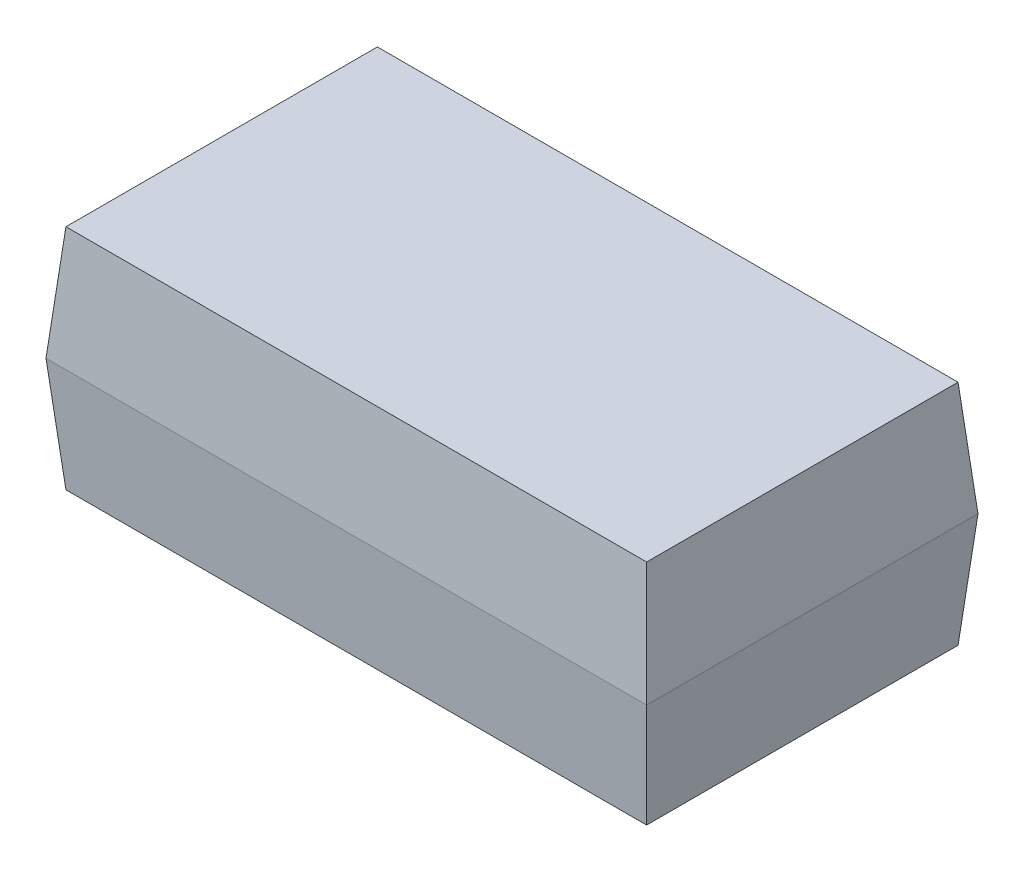
ISO-10303-21;
HEADER;
FILE_DESCRIPTION(('STEP AP214'),'2;1');
FILE_NAME('part.step','',(''),(''),'','','');
FILE_SCHEMA(('AUTOMOTIVE_DESIGN { 1 0 10303 214 1 1 1 1 }'));
ENDSEC;
DATA;
#1=APPLICATION_CONTEXT('core data for automotive mechanical design processes');
#2=APPLICATION_PROTOCOL_DEFINITION('international standard','automotive_design',2000,#1);
#3=PRODUCT_CONTEXT('',#1,'mechanical');
#4=PRODUCT('Part','Part','',(#3));
#5=PRODUCT_RELATED_PRODUCT_CATEGORY('part','',(#4));
#6=PRODUCT_DEFINITION_FORMATION('','',#4);
#7=PRODUCT_DEFINITION_CONTEXT('part definition',#1,'design');
#8=PRODUCT_DEFINITION('design','',#6,#7);
#9=PRODUCT_DEFINITION_SHAPE('','',#8);
#10=(LENGTH_UNIT() NAMED_UNIT(*) SI_UNIT(.MILLI.,.METRE.));
#11=(NAMED_UNIT(*) PLANE_ANGLE_UNIT() SI_UNIT($,.RADIAN.));
#12=(NAMED_UNIT(*) SI_UNIT($,.STERADIAN.) SOLID_ANGLE_UNIT());
#13=UNCERTAINTY_MEASURE_WITH_UNIT(LENGTH_MEASURE(1.E-05),#10,'distance_accuracy_value','');
#14=(GEOMETRIC_REPRESENTATION_CONTEXT(3) GLOBAL_UNCERTAINTY_ASSIGNED_CONTEXT((#13)) GLOBAL_UNIT_ASSIGNED_CONTEXT((#10,
#11,#12)) REPRESENTATION_CONTEXT('',''));
#15=CARTESIAN_POINT('',(0.,0.,0.));
#16=DIRECTION('',(0.,0.,1.));
#17=DIRECTION('',(1.,0.,0.));
#18=AXIS2_PLACEMENT_3D('',#15,#16,#17);
#19=CARTESIAN_POINT('',(-73.75121955751,21.838670418366,23.741835900099));
#20=DIRECTION('',(0.,1.,0.));
#21=DIRECTION('',(0.,0.,1.));
#22=AXIS2_PLACEMENT_3D('',#19,#20,#21);
#23=PLANE('',#22);
#24=DIRECTION('',(1.,0.,0.));
#25=VECTOR('',#24,1.);
#26=CARTESIAN_POINT('',(-73.75121955751,21.838670418366,22.1899546650382));
#27=LINE('',#26,#25);
#28=CARTESIAN_POINT('',(-70.8993383224496,21.838670418366,22.1899546650381));
#29=VERTEX_POINT('',#28);
#30=CARTESIAN_POINT('',(-73.7031007925702,21.838670418366,22.1899546650381));
#31=VERTEX_POINT('',#30);
#32=EDGE_CURVE('E95',#29,#31,#27,.F.);
#33=ORIENTED_EDGE('',*,*,#32,.F.);
#34=DIRECTION('',(0.,0.,1.));
#35=VECTOR('',#34,1.);
#36=CARTESIAN_POINT('',(-70.8993383224492,21.8386704183659,22.141835900099));
#37=LINE('',#36,#35);
#38=CARTESIAN_POINT('',(-70.8993383224498,21.838670418366,23.6937171351599));
#39=VERTEX_POINT('',#38);
#40=EDGE_CURVE('E81',#39,#29,#37,.F.);
#41=ORIENTED_EDGE('',*,*,#40,.F.);
#42=DIRECTION('',(1.,0.,0.));
#43=VECTOR('',#42,1.);
#44=CARTESIAN_POINT('',(-73.75121955751,21.838670418366,23.6937171351598));
#45=LINE('',#44,#43);
#46=CARTESIAN_POINT('',(-73.7031007925704,21.838670418366,23.6937171351599));
#47=VERTEX_POINT('',#46);
#48=EDGE_CURVE('E68',#47,#39,#45,.T.);
#49=ORIENTED_EDGE('',*,*,#48,.F.);
#50=DIRECTION('',(0.,0.,1.));
#51=VECTOR('',#50,1.);
#52=CARTESIAN_POINT('',(-73.7031007925708,21.8386704183659,22.141835900099));
#53=LINE('',#52,#51);
#54=EDGE_CURVE('E20',#31,#47,#53,.T.);
#55=ORIENTED_EDGE('',*,*,#54,.F.);
#56=EDGE_LOOP('',(#33,#41,#49,#55));
#57=FACE_BOUND('',#56,.T.);
#58=ADVANCED_FACE('F17',(#57),#23,.F.);
#59=CARTESIAN_POINT('',(-73.75121955751,22.388670418366,22.141835900099));
#60=DIRECTION('',(-0.996194698091749,-0.087155742747618,0.));
#61=DIRECTION('',(0.087155742747618,-0.996194698091749,0.));
#62=AXIS2_PLACEMENT_3D('',#59,#60,#61);
#63=PLANE('',#62);
#64=ORIENTED_EDGE('',*,*,#54,.T.);
#65=DIRECTION('',(0.0868265938655793,-0.992432509138855,-0.0868265938641958));
#66=VECTOR('',#65,1.);
#67=CARTESIAN_POINT('',(-73.75121955751,22.388670418366,23.741835900099));
#68=LINE('',#67,#66);
#69=CARTESIAN_POINT('',(-73.75121955751,22.388670418366,23.741835900099));
#70=VERTEX_POINT('',#69);
#71=EDGE_CURVE('E74',#70,#47,#68,.T.);
#72=ORIENTED_EDGE('',*,*,#71,.F.);
#73=DIRECTION('',(0.,0.,1.));
#74=VECTOR('',#73,1.);
#75=CARTESIAN_POINT('',(-73.75121955751,22.388670418366,22.141835900099));
#76=LINE('',#75,#74);
#77=CARTESIAN_POINT('',(-73.75121955751,22.388670418366,22.141835900099));
#78=VERTEX_POINT('',#77);
#79=EDGE_CURVE('E98',#78,#70,#76,.T.);
#80=ORIENTED_EDGE('',*,*,#79,.F.);
#81=DIRECTION('',(-0.0868265938655793,0.992432509138855,-0.0868265938641958));
#82=VECTOR('',#81,1.);
#83=CARTESIAN_POINT('',(-73.70310079257,21.838670418366,22.1899546650382));
#84=LINE('',#83,#82);
#85=EDGE_CURVE('E77',#31,#78,#84,.T.);
#86=ORIENTED_EDGE('',*,*,#85,.F.);
#87=EDGE_LOOP('',(#64,#72,#80,#86));
#88=FACE_BOUND('',#87,.T.);
#89=ADVANCED_FACE('F73',(#88),#63,.T.);
#90=CARTESIAN_POINT('',(-73.75121955751,22.388670418366,23.741835900099));
#91=DIRECTION('',(0.,-0.087155742747618,0.996194698091749));
#92=DIRECTION('',(0.,-0.996194698091749,-0.087155742747618));
#93=AXIS2_PLACEMENT_3D('',#90,#91,#92);
#94=PLANE('',#93);
#95=ORIENTED_EDGE('',*,*,#48,.T.);
#96=DIRECTION('',(-0.0868265938642021,-0.992432509139012,-0.0868265938637764));
#97=VECTOR('',#96,1.);
#98=CARTESIAN_POINT('',(-70.85121955751,22.388670418366,23.741835900099));
#99=LINE('',#98,#97);
#100=CARTESIAN_POINT('',(-70.85121955751,22.388670418366,23.741835900099));
#101=VERTEX_POINT('',#100);
#102=EDGE_CURVE('E83',#101,#39,#99,.T.);
#103=ORIENTED_EDGE('',*,*,#102,.F.);
#104=DIRECTION('',(1.,0.,0.));
#105=VECTOR('',#104,1.);
#106=CARTESIAN_POINT('',(-73.75121955751,22.388670418366,23.741835900099));
#107=LINE('',#106,#105);
#108=EDGE_CURVE('E87',#70,#101,#107,.T.);
#109=ORIENTED_EDGE('',*,*,#108,.F.);
#110=ORIENTED_EDGE('',*,*,#71,.T.);
#111=EDGE_LOOP('',(#95,#103,#109,#110));
#112=FACE_BOUND('',#111,.T.);
#113=ADVANCED_FACE('F85',(#112),#94,.T.);
#114=CARTESIAN_POINT('',(-70.85121955751,22.388670418366,22.141835900099));
#115=DIRECTION('',(0.996194698091749,-0.087155742747618,0.));
#116=DIRECTION('',(0.087155742747618,0.996194698091749,0.));
#117=AXIS2_PLACEMENT_3D('',#114,#115,#116);
#118=PLANE('',#117);
#119=ORIENTED_EDGE('',*,*,#40,.T.);
#120=DIRECTION('',(-0.0868265938655793,-0.992432509138855,0.0868265938641958));
#121=VECTOR('',#120,1.);
#122=CARTESIAN_POINT('',(-70.85121955751,22.388670418366,22.141835900099));
#123=LINE('',#122,#121);
#124=CARTESIAN_POINT('',(-70.85121955751,22.388670418366,22.141835900099));
#125=VERTEX_POINT('',#124);
#126=EDGE_CURVE('E92',#125,#29,#123,.T.);
#127=ORIENTED_EDGE('',*,*,#126,.F.);
#128=DIRECTION('',(0.,0.,1.));
#129=VECTOR('',#128,1.);
#130=CARTESIAN_POINT('',(-70.85121955751,22.388670418366,22.141835900099));
#131=LINE('',#130,#129);
#132=EDGE_CURVE('E104',#101,#125,#131,.F.);
#133=ORIENTED_EDGE('',*,*,#132,.F.);
#134=ORIENTED_EDGE('',*,*,#102,.T.);
#135=EDGE_LOOP('',(#119,#127,#133,#134));
#136=FACE_BOUND('',#135,.T.);
#137=ADVANCED_FACE('F137',(#136),#118,.T.);
#138=CARTESIAN_POINT('',(-73.75121955751,22.388670418366,22.141835900099));
#139=DIRECTION('',(0.,-0.087155742747618,-0.996194698091749));
#140=DIRECTION('',(0.,0.996194698091749,-0.087155742747618));
#141=AXIS2_PLACEMENT_3D('',#138,#139,#140);
#142=PLANE('',#141);
#143=ORIENTED_EDGE('',*,*,#32,.T.);
#144=ORIENTED_EDGE('',*,*,#85,.T.);
#145=DIRECTION('',(1.,0.,0.));
#146=VECTOR('',#145,1.);
#147=CARTESIAN_POINT('',(-73.75121955751,22.388670418366,22.141835900099));
#148=LINE('',#147,#146);
#149=EDGE_CURVE('E109',#125,#78,#148,.F.);
#150=ORIENTED_EDGE('',*,*,#149,.F.);
#151=ORIENTED_EDGE('',*,*,#126,.T.);
#152=EDGE_LOOP('',(#143,#144,#150,#151));
#153=FACE_BOUND('',#152,.T.);
#154=ADVANCED_FACE('F135',(#153),#142,.T.);
#155=CARTESIAN_POINT('',(-73.75121955751,22.388670418366,22.141835900099));
#156=DIRECTION('',(-0.996194698091749,0.087155742747618,0.));
#157=DIRECTION('',(-0.087155742747618,-0.996194698091749,0.));
#158=AXIS2_PLACEMENT_3D('',#155,#156,#157);
#159=PLANE('',#158);
#160=DIRECTION('',(0.,0.,1.));
#161=VECTOR('',#160,1.);
#162=CARTESIAN_POINT('',(-73.70310079257,22.938670418366,23.741835900099));
#163=LINE('',#162,#161);
#164=CARTESIAN_POINT('',(-73.7031007925704,22.938670418366,22.1899546650381));
#165=VERTEX_POINT('',#164);
#166=CARTESIAN_POINT('',(-73.7031007925704,22.938670418366,23.6937171351599));
#167=VERTEX_POINT('',#166);
#168=EDGE_CURVE('E116',#165,#167,#163,.T.);
#169=ORIENTED_EDGE('',*,*,#168,.F.);
#170=DIRECTION('',(0.0868265938655793,0.992432509138855,0.0868265938641958));
#171=VECTOR('',#170,1.);
#172=CARTESIAN_POINT('',(-73.75121955751,22.388670418366,22.141835900099));
#173=LINE('',#172,#171);
#174=EDGE_CURVE('E112',#78,#165,#173,.T.);
#175=ORIENTED_EDGE('',*,*,#174,.F.);
#176=ORIENTED_EDGE('',*,*,#79,.T.);
#177=DIRECTION('',(-0.0868265938655793,-0.992432509138855,0.0868265938641958));
#178=VECTOR('',#177,1.);
#179=CARTESIAN_POINT('',(-73.70310079257,22.938670418366,23.6937171351598));
#180=LINE('',#179,#178);
#181=EDGE_CURVE('E101',#167,#70,#180,.T.);
#182=ORIENTED_EDGE('',*,*,#181,.F.);
#183=EDGE_LOOP('',(#169,#175,#176,#182));
#184=FACE_BOUND('',#183,.T.);
#185=ADVANCED_FACE('F131',(#184),#159,.T.);
#186=CARTESIAN_POINT('',(-73.75121955751,22.388670418366,23.741835900099));
#187=DIRECTION('',(0.,0.087155742747618,0.996194698091749));
#188=DIRECTION('',(0.,-0.996194698091749,0.087155742747618));
#189=AXIS2_PLACEMENT_3D('',#186,#187,#188);
#190=PLANE('',#189);
#191=DIRECTION('',(1.,0.,0.));
#192=VECTOR('',#191,1.);
#193=CARTESIAN_POINT('',(-73.75121955751,22.938670418366,23.69371713516));
#194=LINE('',#193,#192);
#195=CARTESIAN_POINT('',(-70.8993383224498,22.938670418366,23.6937171351599));
#196=VERTEX_POINT('',#195);
#197=EDGE_CURVE('E119',#167,#196,#194,.T.);
#198=ORIENTED_EDGE('',*,*,#197,.F.);
#199=ORIENTED_EDGE('',*,*,#181,.T.);
#200=ORIENTED_EDGE('',*,*,#108,.T.);
#201=DIRECTION('',(0.0868265938642021,-0.992432509139012,0.0868265938637764));
#202=VECTOR('',#201,1.);
#203=CARTESIAN_POINT('',(-70.8993383224492,22.9386704183661,23.69371713516));
#204=LINE('',#203,#202);
#205=EDGE_CURVE('E106',#196,#101,#204,.T.);
#206=ORIENTED_EDGE('',*,*,#205,.F.);
#207=EDGE_LOOP('',(#198,#199,#200,#206));
#208=FACE_BOUND('',#207,.T.);
#209=ADVANCED_FACE('F129',(#208),#190,.T.);
#210=CARTESIAN_POINT('',(-70.85121955751,22.388670418366,22.141835900099));
#211=DIRECTION('',(0.996194698091749,0.087155742747618,0.));
#212=DIRECTION('',(-0.087155742747618,0.996194698091749,0.));
#213=AXIS2_PLACEMENT_3D('',#210,#211,#212);
#214=PLANE('',#213);
#215=DIRECTION('',(0.,0.,1.));
#216=VECTOR('',#215,1.);
#217=CARTESIAN_POINT('',(-70.89933832245,22.938670418366,23.741835900099));
#218=LINE('',#217,#216);
#219=CARTESIAN_POINT('',(-70.8993383224496,22.938670418366,22.1899546650381));
#220=VERTEX_POINT('',#219);
#221=EDGE_CURVE('E26',#196,#220,#218,.F.);
#222=ORIENTED_EDGE('',*,*,#221,.F.);
#223=ORIENTED_EDGE('',*,*,#205,.T.);
#224=ORIENTED_EDGE('',*,*,#132,.T.);
#225=DIRECTION('',(0.0868265938655793,-0.992432509138855,-0.0868265938641958));
#226=VECTOR('',#225,1.);
#227=CARTESIAN_POINT('',(-70.89933832245,22.938670418366,22.1899546650382));
#228=LINE('',#227,#226);
#229=EDGE_CURVE('E35',#220,#125,#228,.T.);
#230=ORIENTED_EDGE('',*,*,#229,.F.);
#231=EDGE_LOOP('',(#222,#223,#224,#230));
#232=FACE_BOUND('',#231,.T.);
#233=ADVANCED_FACE('F126',(#232),#214,.T.);
#234=CARTESIAN_POINT('',(-73.75121955751,22.388670418366,22.141835900099));
#235=DIRECTION('',(0.,0.087155742747618,-0.996194698091749));
#236=DIRECTION('',(0.,0.996194698091749,0.087155742747618));
#237=AXIS2_PLACEMENT_3D('',#234,#235,#236);
#238=PLANE('',#237);
#239=DIRECTION('',(1.,0.,0.));
#240=VECTOR('',#239,1.);
#241=CARTESIAN_POINT('',(-73.75121955751,22.938670418366,22.189954665038));
#242=LINE('',#241,#240);
#243=EDGE_CURVE('E11',#220,#165,#242,.F.);
#244=ORIENTED_EDGE('',*,*,#243,.F.);
#245=ORIENTED_EDGE('',*,*,#229,.T.);
#246=ORIENTED_EDGE('',*,*,#149,.T.);
#247=ORIENTED_EDGE('',*,*,#174,.T.);
#248=EDGE_LOOP('',(#244,#245,#246,#247));
#249=FACE_BOUND('',#248,.T.);
#250=ADVANCED_FACE('F148',(#249),#238,.T.);
#251=CARTESIAN_POINT('',(-73.75121955751,22.938670418366,23.741835900099));
#252=DIRECTION('',(0.,1.,0.));
#253=DIRECTION('',(0.,0.,1.));
#254=AXIS2_PLACEMENT_3D('',#251,#252,#253);
#255=PLANE('',#254);
#256=ORIENTED_EDGE('',*,*,#221,.T.);
#257=ORIENTED_EDGE('',*,*,#243,.T.);
#258=ORIENTED_EDGE('',*,*,#168,.T.);
#259=ORIENTED_EDGE('',*,*,#197,.T.);
#260=EDGE_LOOP('',(#256,#257,#258,#259));
#261=FACE_BOUND('',#260,.T.);
#262=ADVANCED_FACE('F124',(#261),#255,.T.);
#263=CLOSED_SHELL('',(#58,#89,#113,#137,#154,#185,#209,#233,#250,#262));
#264=MANIFOLD_SOLID_BREP('B1',#263);
#265=ADVANCED_BREP_SHAPE_REPRESENTATION('',(#18,#264),#14);
#266=SHAPE_DEFINITION_REPRESENTATION(#9,#265);
ENDSEC;
END-ISO-10303-21;
